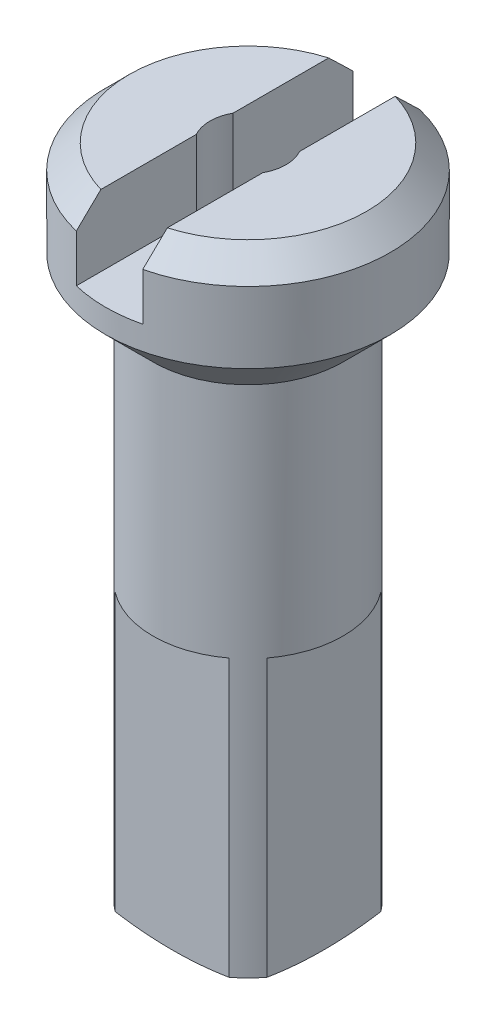
ISO-10303-21;
HEADER;
FILE_DESCRIPTION(('STEP AP214'),'2;1');
FILE_NAME('part.step','',(''),(''),'','','');
FILE_SCHEMA(('AUTOMOTIVE_DESIGN { 1 0 10303 214 1 1 1 1 }'));
ENDSEC;
DATA;
#1=APPLICATION_CONTEXT('core data for automotive mechanical design processes');
#2=APPLICATION_PROTOCOL_DEFINITION('international standard','automotive_design',2000,#1);
#3=PRODUCT_CONTEXT('',#1,'mechanical');
#4=PRODUCT('Part','Part','',(#3));
#5=PRODUCT_RELATED_PRODUCT_CATEGORY('part','',(#4));
#6=PRODUCT_DEFINITION_FORMATION('','',#4);
#7=PRODUCT_DEFINITION_CONTEXT('part definition',#1,'design');
#8=PRODUCT_DEFINITION('design','',#6,#7);
#9=PRODUCT_DEFINITION_SHAPE('','',#8);
#10=(LENGTH_UNIT() NAMED_UNIT(*) SI_UNIT(.MILLI.,.METRE.));
#11=(NAMED_UNIT(*) PLANE_ANGLE_UNIT() SI_UNIT($,.RADIAN.));
#12=(NAMED_UNIT(*) SI_UNIT($,.STERADIAN.) SOLID_ANGLE_UNIT());
#13=UNCERTAINTY_MEASURE_WITH_UNIT(LENGTH_MEASURE(1.E-05),#10,'distance_accuracy_value','');
#14=(GEOMETRIC_REPRESENTATION_CONTEXT(3) GLOBAL_UNCERTAINTY_ASSIGNED_CONTEXT((#13)) GLOBAL_UNIT_ASSIGNED_CONTEXT((#10,
#11,#12)) REPRESENTATION_CONTEXT('',''));
#15=CARTESIAN_POINT('',(0.,0.,0.));
#16=DIRECTION('',(0.,0.,1.));
#17=DIRECTION('',(1.,0.,0.));
#18=AXIS2_PLACEMENT_3D('',#15,#16,#17);
#19=CARTESIAN_POINT('',(0.,-17.3253086419753,0.));
#20=DIRECTION('',(0.,-1.00000000000001,0.));
#21=DIRECTION('',(0.,0.,-1.));
#22=AXIS2_PLACEMENT_3D('',#19,#20,#21);
#23=CYLINDRICAL_SURFACE('',#22,2.);
#24=CARTESIAN_POINT('',(0.,-2.99999999999961,0.));
#25=DIRECTION('',(0.,-1.00000000000001,0.));
#26=DIRECTION('',(0.,0.,-1.));
#27=AXIS2_PLACEMENT_3D('',#24,#25,#26);
#28=CIRCLE('',#27,2.);
#29=CARTESIAN_POINT('',(0.,-2.99999999999961,-2.00000000000004));
#30=VERTEX_POINT('',#29);
#31=EDGE_CURVE('E244',#30,#30,#28,.T.);
#32=ORIENTED_EDGE('',*,*,#31,.T.);
#33=EDGE_LOOP('',(#32));
#34=FACE_BOUND('',#33,.T.);
#35=DIRECTION('',(0.,-1.00000000000001,0.));
#36=VECTOR('',#35,1.);
#37=CARTESIAN_POINT('',(-1.60000000000001,-17.3253086419759,-1.19999999999996));
#38=LINE('',#37,#36);
#39=CARTESIAN_POINT('',(-1.60000000000003,-7.99999999999923,-1.20000000000007));
#40=VERTEX_POINT('',#39);
#41=CARTESIAN_POINT('',(-1.60000000000002,-13.8250385398487,-1.20000000000002));
#42=VERTEX_POINT('',#41);
#43=EDGE_CURVE('E43',#40,#42,#38,.T.);
#44=ORIENTED_EDGE('',*,*,#43,.F.);
#45=CARTESIAN_POINT('',(0.,-8.00000000000012,0.));
#46=DIRECTION('',(0.,1.00000000000001,0.));
#47=DIRECTION('',(0.,0.,1.));
#48=AXIS2_PLACEMENT_3D('',#45,#46,#47);
#49=CIRCLE('',#48,2.);
#50=CARTESIAN_POINT('',(-1.60000000000002,-8.00000000000034,1.20000000000006));
#51=VERTEX_POINT('',#50);
#52=EDGE_CURVE('E12',#40,#51,#49,.T.);
#53=ORIENTED_EDGE('',*,*,#52,.T.);
#54=DIRECTION('',(0.,-1.00000000000001,0.));
#55=VECTOR('',#54,1.);
#56=CARTESIAN_POINT('',(-1.60000000000001,-17.3253086419755,1.19999999999992));
#57=LINE('',#56,#55);
#58=CARTESIAN_POINT('',(-1.59999999999999,-13.8250385398481,1.19999999999997));
#59=VERTEX_POINT('',#58);
#60=EDGE_CURVE('E183',#59,#51,#57,.F.);
#61=ORIENTED_EDGE('',*,*,#60,.F.);
#62=CARTESIAN_POINT('',(0.,-13.8250385398488,0.));
#63=DIRECTION('',(0.,-1.00000000000001,0.));
#64=DIRECTION('',(0.,0.,-1.));
#65=AXIS2_PLACEMENT_3D('',#62,#63,#64);
#66=CIRCLE('',#65,2.);
#67=CARTESIAN_POINT('',(-1.20000000000003,-13.8250385398487,1.59999999999998));
#68=VERTEX_POINT('',#67);
#69=EDGE_CURVE('E169',#68,#59,#66,.T.);
#70=ORIENTED_EDGE('',*,*,#69,.F.);
#71=DIRECTION('',(0.,-1.00000000000001,0.));
#72=VECTOR('',#71,1.);
#73=CARTESIAN_POINT('',(-1.20000000000003,-17.3253086419754,1.60000000000005));
#74=LINE('',#73,#72);
#75=CARTESIAN_POINT('',(-1.20000000000002,-8.00000000000067,1.59999999999999));
#76=VERTEX_POINT('',#75);
#77=EDGE_CURVE('E51',#76,#68,#74,.T.);
#78=ORIENTED_EDGE('',*,*,#77,.F.);
#79=CARTESIAN_POINT('',(1.19999999999997,-8.00000000000095,1.59999999999999));
#80=VERTEX_POINT('',#79);
#81=EDGE_CURVE('E31',#76,#80,#49,.T.);
#82=ORIENTED_EDGE('',*,*,#81,.T.);
#83=DIRECTION('',(0.,-1.00000000000001,0.));
#84=VECTOR('',#83,1.);
#85=CARTESIAN_POINT('',(1.19999999999997,-17.3253086419757,1.6));
#86=LINE('',#85,#84);
#87=CARTESIAN_POINT('',(1.2,-13.8250385398482,1.59999999999991));
#88=VERTEX_POINT('',#87);
#89=EDGE_CURVE('E162',#88,#80,#86,.F.);
#90=ORIENTED_EDGE('',*,*,#89,.F.);
#91=CARTESIAN_POINT('',(1.6,-13.8250385398496,1.19999999999999));
#92=VERTEX_POINT('',#91);
#93=EDGE_CURVE('E245',#92,#88,#66,.T.);
#94=ORIENTED_EDGE('',*,*,#93,.F.);
#95=DIRECTION('',(0.,-1.00000000000001,0.));
#96=VECTOR('',#95,1.);
#97=CARTESIAN_POINT('',(1.59999999999998,-17.3253086419751,1.2));
#98=LINE('',#97,#96);
#99=CARTESIAN_POINT('',(1.59999999999998,-8.00000000000017,1.19999999999997));
#100=VERTEX_POINT('',#99);
#101=EDGE_CURVE('E172',#100,#92,#98,.T.);
#102=ORIENTED_EDGE('',*,*,#101,.F.);
#103=CARTESIAN_POINT('',(1.59999999999999,-7.99999999999995,-1.2));
#104=VERTEX_POINT('',#103);
#105=EDGE_CURVE('E159',#100,#104,#49,.T.);
#106=ORIENTED_EDGE('',*,*,#105,.T.);
#107=DIRECTION('',(0.,-1.00000000000001,0.));
#108=VECTOR('',#107,1.);
#109=CARTESIAN_POINT('',(1.59999999999998,-17.3253086419752,-1.20000000000003));
#110=LINE('',#109,#108);
#111=CARTESIAN_POINT('',(1.59999999999998,-13.8250385398487,-1.19999999999997));
#112=VERTEX_POINT('',#111);
#113=EDGE_CURVE('E170',#112,#104,#110,.F.);
#114=ORIENTED_EDGE('',*,*,#113,.F.);
#115=CARTESIAN_POINT('',(1.19999999999997,-13.8250385398483,-1.6));
#116=VERTEX_POINT('',#115);
#117=EDGE_CURVE('E241',#116,#112,#66,.T.);
#118=ORIENTED_EDGE('',*,*,#117,.F.);
#119=DIRECTION('',(0.,-1.00000000000001,0.));
#120=VECTOR('',#119,1.);
#121=CARTESIAN_POINT('',(1.19999999999999,-17.3253086419752,-1.6));
#122=LINE('',#121,#120);
#123=CARTESIAN_POINT('',(1.2,-7.99999999999912,-1.60000000000002));
#124=VERTEX_POINT('',#123);
#125=EDGE_CURVE('E181',#124,#116,#122,.T.);
#126=ORIENTED_EDGE('',*,*,#125,.F.);
#127=CARTESIAN_POINT('',(-1.20000000000003,-7.99999999999962,-1.60000000000008));
#128=VERTEX_POINT('',#127);
#129=EDGE_CURVE('E36',#124,#128,#49,.T.);
#130=ORIENTED_EDGE('',*,*,#129,.T.);
#131=DIRECTION('',(0.,-1.00000000000001,0.));
#132=VECTOR('',#131,1.);
#133=CARTESIAN_POINT('',(-1.20000000000002,-17.3253086419753,-1.60000000000002));
#134=LINE('',#133,#132);
#135=CARTESIAN_POINT('',(-1.20000000000004,-13.8250385398493,-1.6));
#136=VERTEX_POINT('',#135);
#137=EDGE_CURVE('E179',#136,#128,#134,.F.);
#138=ORIENTED_EDGE('',*,*,#137,.F.);
#139=EDGE_CURVE('E240',#42,#136,#66,.T.);
#140=ORIENTED_EDGE('',*,*,#139,.F.);
#141=EDGE_LOOP('',(#44,#53,#61,#70,#78,#82,#90,#94,#102,#106,#114,#118,#126,#130,#138,#140));
#142=FACE_BOUND('',#141,.T.);
#143=ADVANCED_FACE('F27',(#34,#142),#23,.T.);
#144=CARTESIAN_POINT('',(0.,-6.59662239244813,0.));
#145=DIRECTION('',(0.,-1.00000000000001,0.));
#146=DIRECTION('',(-0.999999999999998,0.,0.));
#147=AXIS2_PLACEMENT_3D('',#144,#145,#146);
#148=SPHERICAL_SURFACE('',#147,7.5);
#149=CARTESIAN_POINT('',(0.,-14.0000000000001,0.));
#150=DIRECTION('',(0.,-1.00000000000001,0.));
#151=DIRECTION('',(0.,0.,-1.));
#152=AXIS2_PLACEMENT_3D('',#149,#150,#151);
#153=CIRCLE('',#152,1.2);
#154=CARTESIAN_POINT('',(0.,-14.0000000000001,-1.19999999999997));
#155=VERTEX_POINT('',#154);
#156=EDGE_CURVE('E237',#155,#155,#153,.T.);
#157=ORIENTED_EDGE('',*,*,#156,.F.);
#158=EDGE_LOOP('',(#157));
#159=FACE_BOUND('',#158,.T.);
#160=CARTESIAN_POINT('',(-1.60000000000003,-6.59662239244857,0.));
#161=DIRECTION('',(-0.999999999999998,0.,0.));
#162=DIRECTION('',(0.,0.,1.));
#163=AXIS2_PLACEMENT_3D('',#160,#161,#162);
#164=CIRCLE('',#163,7.32734604068895);
#165=EDGE_CURVE('E160',#42,#59,#164,.T.);
#166=ORIENTED_EDGE('',*,*,#165,.F.);
#167=ORIENTED_EDGE('',*,*,#139,.T.);
#168=CARTESIAN_POINT('',(0.,-6.59662239244746,-1.60000000000004));
#169=DIRECTION('',(0.,0.,-1.));
#170=DIRECTION('',(-0.999999999999998,0.,0.));
#171=AXIS2_PLACEMENT_3D('',#168,#169,#170);
#172=CIRCLE('',#171,7.32734604068895);
#173=EDGE_CURVE('E364',#116,#136,#172,.T.);
#174=ORIENTED_EDGE('',*,*,#173,.F.);
#175=ORIENTED_EDGE('',*,*,#117,.T.);
#176=CARTESIAN_POINT('',(1.59999999999999,-6.59662239244835,0.));
#177=DIRECTION('',(0.999999999999998,0.,0.));
#178=DIRECTION('',(0.,0.,-1.));
#179=AXIS2_PLACEMENT_3D('',#176,#177,#178);
#180=CIRCLE('',#179,7.32734604068895);
#181=EDGE_CURVE('E360',#92,#112,#180,.T.);
#182=ORIENTED_EDGE('',*,*,#181,.F.);
#183=ORIENTED_EDGE('',*,*,#93,.T.);
#184=CARTESIAN_POINT('',(0.,-6.59662239244879,1.60000000000002));
#185=DIRECTION('',(0.,0.,1.));
#186=DIRECTION('',(0.999999999999998,0.,0.));
#187=AXIS2_PLACEMENT_3D('',#184,#185,#186);
#188=CIRCLE('',#187,7.32734604068895);
#189=EDGE_CURVE('E359',#68,#88,#188,.T.);
#190=ORIENTED_EDGE('',*,*,#189,.F.);
#191=ORIENTED_EDGE('',*,*,#69,.T.);
#192=EDGE_LOOP('',(#166,#167,#174,#175,#182,#183,#190,#191));
#193=FACE_BOUND('',#192,.T.);
#194=ADVANCED_FACE('F303',(#159,#193),#148,.T.);
#195=CARTESIAN_POINT('',(-0.800000000000018,6.10622663543836E-13,0.));
#196=DIRECTION('',(0.,-1.00000000000001,0.));
#197=DIRECTION('',(0.,0.,-1.));
#198=AXIS2_PLACEMENT_3D('',#195,#196,#197);
#199=PLANE('',#198);
#200=CARTESIAN_POINT('',(0.,0.,0.));
#201=DIRECTION('',(0.,-1.00000000000001,0.));
#202=DIRECTION('',(0.,0.,-1.));
#203=AXIS2_PLACEMENT_3D('',#200,#201,#202);
#204=CIRCLE('',#203,2.5);
#205=CARTESIAN_POINT('',(-0.700000000000011,1.11022302462516E-13,-2.39999999999999));
#206=VERTEX_POINT('',#205);
#207=CARTESIAN_POINT('',(-0.700000000000034,-1.66533453693773E-13,2.39999999999999));
#208=VERTEX_POINT('',#207);
#209=EDGE_CURVE('E255',#206,#208,#204,.F.);
#210=ORIENTED_EDGE('',*,*,#209,.T.);
#211=DIRECTION('',(0.,0.,1.));
#212=VECTOR('',#211,1.);
#213=CARTESIAN_POINT('',(-0.700000000000027,0.,-3.));
#214=LINE('',#213,#212);
#215=CARTESIAN_POINT('',(-0.700000000000041,-1.66533453693773E-13,0.3872983346207));
#216=VERTEX_POINT('',#215);
#217=EDGE_CURVE('E186',#216,#208,#214,.T.);
#218=ORIENTED_EDGE('',*,*,#217,.F.);
#219=CARTESIAN_POINT('',(0.,0.,0.));
#220=DIRECTION('',(0.,-1.00000000000001,0.));
#221=DIRECTION('',(0.,0.,-1.));
#222=AXIS2_PLACEMENT_3D('',#219,#220,#221);
#223=CIRCLE('',#222,0.8);
#224=CARTESIAN_POINT('',(-0.699999999999999,6.10622663543836E-13,-0.387298334620735));
#225=VERTEX_POINT('',#224);
#226=EDGE_CURVE('E227',#216,#225,#223,.T.);
#227=ORIENTED_EDGE('',*,*,#226,.T.);
#228=EDGE_CURVE('E188',#206,#225,#214,.T.);
#229=ORIENTED_EDGE('',*,*,#228,.F.);
#230=EDGE_LOOP('',(#210,#218,#227,#229));
#231=FACE_BOUND('',#230,.T.);
#232=ADVANCED_FACE('F310',(#231),#199,.F.);
#233=CARTESIAN_POINT('',(0.,-0.499999999999778,0.));
#234=DIRECTION('',(0.,-1.00000000000001,0.));
#235=DIRECTION('',(0.,0.,-1.));
#236=AXIS2_PLACEMENT_3D('',#233,#234,#235);
#237=CONICAL_SURFACE('',#236,3.,0.78539816339745);
#238=CARTESIAN_POINT('',(-0.700000000000017,-4.11267837363771,-6.57552395426984));
#239=CARTESIAN_POINT('',(-0.700000000000024,-3.92301081977909,-6.38478036232658));
#240=CARTESIAN_POINT('',(-0.700000000000027,-3.73338557460652,-6.19399466736224));
#241=CARTESIAN_POINT('',(-0.700000000000029,-3.35423155800773,-5.81227402664939));
#242=CARTESIAN_POINT('',(-0.700000000000028,-3.16470280394466,-5.62133906365563));
#243=CARTESIAN_POINT('',(-0.700000000000028,-2.78517584282959,-5.23867209630791));
#244=CARTESIAN_POINT('',(-0.700000000000028,-2.5951781758625,-5.04693955608172));
#245=CARTESIAN_POINT('',(-0.700000000000028,-2.21543987689608,-4.66327293310283));
#246=CARTESIAN_POINT('',(-0.700000000000028,-2.02569921283583,-4.471338882074));
#247=CARTESIAN_POINT('',(-0.700000000000028,-1.5714182129493,-4.01103176965299));
#248=CARTESIAN_POINT('',(-0.700000000000029,-1.30703134017998,-3.74250697714998));
#249=CARTESIAN_POINT('',(-0.700000000000029,-0.911273570529878,-3.33878342656647));
#250=CARTESIAN_POINT('',(-0.700000000000029,-0.779459115497286,-3.20401961997148));
#251=CARTESIAN_POINT('',(-0.700000000000029,-0.516271036792303,-2.93407602524108));
#252=CARTESIAN_POINT('',(-0.700000000000029,-0.384897389518707,-2.79889626014404));
#253=CARTESIAN_POINT('',(-0.700000000000029,-0.123195297111526,-2.52830610706533));
#254=CARTESIAN_POINT('',(-0.700000000000029,0.0071350951152486,-2.3928976030103));
#255=CARTESIAN_POINT('',(-0.700000000000029,0.266787508907384,-2.12105937223387));
#256=CARTESIAN_POINT('',(-0.700000000000029,0.396109317429233,-1.98462944107911));
#257=CARTESIAN_POINT('',(-0.700000000000029,0.588633010666352,-1.77873561986846));
#258=CARTESIAN_POINT('',(-0.70000000000003,0.652535702083623,-1.70992773783144));
#259=CARTESIAN_POINT('',(-0.700000000000029,0.779677995979203,-1.57170281667876));
#260=CARTESIAN_POINT('',(-0.700000000000027,0.842917611890001,-1.50228578995559));
#261=CARTESIAN_POINT('',(-0.700000000000032,0.96841247649111,-1.36260789138266));
#262=CARTESIAN_POINT('',(-0.700000000000038,1.03066804490164,-1.29234730722837));
#263=CARTESIAN_POINT('',(-0.700000000000021,1.15370572568725,-1.15055077991614));
#264=CARTESIAN_POINT('',(-0.699999999999996,1.21448803755741,-1.07901501173458));
#265=CARTESIAN_POINT('',(-0.700000000000015,1.29718344015595,-0.978274405697599));
#266=CARTESIAN_POINT('',(-0.700000000000026,1.32014114678459,-0.949927936687709));
#267=CARTESIAN_POINT('',(-0.700000000000034,1.36558654555469,-0.892856998726736));
#268=CARTESIAN_POINT('',(-0.700000000000031,1.38807421024344,-0.864132507856136));
#269=CARTESIAN_POINT('',(-0.700000000000028,1.43250501678596,-0.806159354933486));
#270=CARTESIAN_POINT('',(-0.700000000000029,1.45444679133065,-0.776909641694235));
#271=CARTESIAN_POINT('',(-0.70000000000003,1.4975561052671,-0.717845233228813));
#272=CARTESIAN_POINT('',(-0.700000000000029,1.5187236921678,-0.688030572842337));
#273=CARTESIAN_POINT('',(-0.70000000000003,1.55956277185305,-0.628397609543758));
#274=CARTESIAN_POINT('',(-0.70000000000003,1.57925754399882,-0.598595339755328));
#275=CARTESIAN_POINT('',(-0.700000000000029,1.61734551620212,-0.538172236658653));
#276=CARTESIAN_POINT('',(-0.700000000000027,1.63573900831914,-0.507551589166462));
#277=CARTESIAN_POINT('',(-0.700000000000032,1.67070401695575,-0.445409706613224));
#278=CARTESIAN_POINT('',(-0.700000000000038,1.68728133398369,-0.413891769361653));
#279=CARTESIAN_POINT('',(-0.700000000000022,1.71801347852738,-0.349708018920922));
#280=CARTESIAN_POINT('',(-0.7,1.73217075067366,-0.317043404758527));
#281=CARTESIAN_POINT('',(-0.70000000000001,1.75249213341929,-0.262941491411196));
#282=CARTESIAN_POINT('',(-0.700000000000024,1.7596632881924,-0.241885007618641));
#283=CARTESIAN_POINT('',(-0.700000000000035,1.77246356715623,-0.199308339763908));
#284=CARTESIAN_POINT('',(-0.700000000000032,1.77809255000601,-0.177788113394297));
#285=CARTESIAN_POINT('',(-0.700000000000025,1.79220576963066,-0.112849032392101));
#286=CARTESIAN_POINT('',(-0.700000000000022,1.79802065121236,-0.0687903185515554));
#287=CARTESIAN_POINT('',(-0.700000000000024,1.80112661125644,0.0199189402820946));
#288=CARTESIAN_POINT('',(-0.700000000000028,1.79836244733507,0.0645714696930973));
#289=CARTESIAN_POINT('',(-0.700000000000031,1.78486551445167,0.152783563875291));
#290=CARTESIAN_POINT('',(-0.700000000000029,1.77409604002,0.196337135635894));
#291=CARTESIAN_POINT('',(-0.700000000000028,1.74675830151373,0.281022099669121));
#292=CARTESIAN_POINT('',(-0.70000000000003,1.73024652915394,0.322172686253591));
#293=CARTESIAN_POINT('',(-0.70000000000003,1.69323845925868,0.40267184433412));
#294=CARTESIAN_POINT('',(-0.700000000000028,1.67273531340072,0.442017172950594));
#295=CARTESIAN_POINT('',(-0.700000000000031,1.62890499307269,0.519453413889727));
#296=CARTESIAN_POINT('',(-0.700000000000035,1.60555825450233,0.557533042326062));
#297=CARTESIAN_POINT('',(-0.700000000000024,1.55703602592909,0.632450062660897));
#298=CARTESIAN_POINT('',(-0.700000000000009,1.53186203849033,0.669288439554436));
#299=CARTESIAN_POINT('',(-0.700000000000007,1.4780815773246,0.745041416598977));
#300=CARTESIAN_POINT('',(-0.700000000000023,1.44936334950984,0.783876100518569));
#301=CARTESIAN_POINT('',(-0.700000000000036,1.3908433681408,0.860723249482076));
#302=CARTESIAN_POINT('',(-0.700000000000032,1.36104146370459,0.898735598846912));
#303=CARTESIAN_POINT('',(-0.700000000000025,1.2704375843275,1.01187256789841));
#304=CARTESIAN_POINT('',(-0.700000000000028,1.20846632319658,1.0860578230274));
#305=CARTESIAN_POINT('',(-0.700000000000031,1.08263133847016,1.23302643475662));
#306=CARTESIAN_POINT('',(-0.70000000000003,1.01876428351992,1.30580690112389));
#307=CARTESIAN_POINT('',(-0.700000000000029,0.889911302287086,1.4503292775563));
#308=CARTESIAN_POINT('',(-0.70000000000003,0.824925719155832,1.52207149413541));
#309=CARTESIAN_POINT('',(-0.70000000000003,0.694342743232183,1.66469678369502));
#310=CARTESIAN_POINT('',(-0.70000000000003,0.628747064634135,1.73558143166386));
#311=CARTESIAN_POINT('',(-0.70000000000003,0.497016135847303,1.87685691083946));
#312=CARTESIAN_POINT('',(-0.70000000000003,0.430880845393854,1.94724770445335));
#313=CARTESIAN_POINT('',(-0.700000000000029,0.232048140350243,2.15771678265417));
#314=CARTESIAN_POINT('',(-0.700000000000027,0.0987761296277188,2.2972516439705));
#315=CARTESIAN_POINT('',(-0.700000000000027,-0.203030523568541,2.61126170228683));
#316=CARTESIAN_POINT('',(-0.700000000000029,-0.371818305150281,2.7854928212261));
#317=CARTESIAN_POINT('',(-0.70000000000003,-0.710186317399799,3.1331877943132));
#318=CARTESIAN_POINT('',(-0.70000000000003,-0.87976655976597,3.30665163706037));
#319=CARTESIAN_POINT('',(-0.700000000000029,-1.38939109811971,3.82650453677007));
#320=CARTESIAN_POINT('',(-0.700000000000029,-1.73015595359525,4.17218658000089));
#321=CARTESIAN_POINT('',(-0.70000000000003,-2.41103868943589,4.86116499996148));
#322=CARTESIAN_POINT('',(-0.700000000000031,-2.7511527488021,5.20446516132608));
#323=CARTESIAN_POINT('',(-0.700000000000029,-3.26160142582111,5.71896032997363));
#324=CARTESIAN_POINT('',(-0.700000000000027,-3.43175225537459,5.8903376524664));
#325=CARTESIAN_POINT('',(-0.700000000000031,-3.7721498149686,6.23299628430987));
#326=CARTESIAN_POINT('',(-0.700000000000036,-3.94239654479693,6.40427759387137));
#327=CARTESIAN_POINT('',(-0.700000000000048,-4.11267837363805,6.57552395426987));
#328=B_SPLINE_CURVE_WITH_KNOTS('',3,(#238,#239,#240,#241,#242,#243,#244,#245,#246,#247,#248,
#249,#250,#251,#252,#253,#254,#255,#256,#257,#258,#259,#260,#261,#262,#263,#264,#265,#266,#267,
#268,#269,#270,#271,#272,#273,#274,#275,#276,#277,#278,#279,#280,#281,#282,#283,#284,#285,#286,
#287,#288,#289,#290,#291,#292,#293,#294,#295,#296,#297,#298,#299,#300,#301,#302,#303,#304,#305,
#306,#307,#308,#309,#310,#311,#312,#313,#314,#315,#316,#317,#318,#319,#320,#321,#322,#323,#324,
#325,#326,#327),.UNSPECIFIED.,.F.,.F.,(4,2,2,2,2,2,2,2,2,2,2,2,2,2,2,2,2,2,2,2,2,2,2,2,2,2,2,2,
2,2,2,2,2,2,2,2,2,2,2,2,2,2,2,2,4),(0.,0.806977153790863,1.6140680397872,2.42384826610812,
3.23351591710163,4.36402380844408,4.92955574844324,5.49505691015564,6.05887494208497,
6.62280900822355,6.90452016877082,7.1862256113841,7.46783756341355,7.74941116661387,
7.85883867169515,7.96827255011133,8.07795744176208,8.18763559113466,8.29477703393027,
8.40189435309281,8.50865892239354,8.61531499684757,8.68199436301535,8.74867983834193,
8.88121544996418,9.01460625444733,9.14861247661523,9.28133601428111,9.41428931614784,
9.54821535253698,9.68203248139371,9.82690533667768,9.97179844064679,10.2617307869164,
10.5522069057218,10.8425954444747,11.1323278384884,11.4220820531021,12.0009374135891,
12.7286782160555,13.4564297956637,14.9126365345611,16.3623925093967,17.0868877436305,
17.8113813809737),.UNSPECIFIED.);
#329=CARTESIAN_POINT('',(-0.70000000000001,-0.500000000000056,-2.91719042916296));
#330=VERTEX_POINT('',#329);
#331=EDGE_CURVE('E339',#330,#206,#328,.T.);
#332=ORIENTED_EDGE('',*,*,#331,.F.);
#333=CARTESIAN_POINT('',(0.,-0.499999999999778,0.));
#334=DIRECTION('',(0.,-1.00000000000001,0.));
#335=DIRECTION('',(0.,0.,-1.));
#336=AXIS2_PLACEMENT_3D('',#333,#334,#335);
#337=CIRCLE('',#336,3.);
#338=CARTESIAN_POINT('',(-0.70000000000002,-0.499999999999556,2.91719042916289));
#339=VERTEX_POINT('',#338);
#340=EDGE_CURVE('E251',#339,#330,#337,.T.);
#341=ORIENTED_EDGE('',*,*,#340,.F.);
#342=EDGE_CURVE('E267',#208,#339,#328,.T.);
#343=ORIENTED_EDGE('',*,*,#342,.F.);
#344=ORIENTED_EDGE('',*,*,#209,.F.);
#345=EDGE_LOOP('',(#332,#341,#343,#344));
#346=FACE_BOUND('',#345,.T.);
#347=ADVANCED_FACE('F297',(#346),#237,.T.);
#348=CARTESIAN_POINT('',(0.,-17.3253086419753,0.));
#349=DIRECTION('',(0.,-1.00000000000001,0.));
#350=DIRECTION('',(0.,0.,-1.));
#351=AXIS2_PLACEMENT_3D('',#348,#349,#350);
#352=CYLINDRICAL_SURFACE('',#351,3.);
#353=ORIENTED_EDGE('',*,*,#340,.T.);
#354=DIRECTION('',(0.,-1.00000000000001,0.));
#355=VECTOR('',#354,1.);
#356=CARTESIAN_POINT('',(-0.700000000000015,-17.3253086419746,-2.91719042916297));
#357=LINE('',#356,#355);
#358=CARTESIAN_POINT('',(-0.700000000000041,-1.50000000000022,-2.9171904291629));
#359=VERTEX_POINT('',#358);
#360=EDGE_CURVE('E215',#330,#359,#357,.T.);
#361=ORIENTED_EDGE('',*,*,#360,.T.);
#362=CARTESIAN_POINT('',(0.,-1.5000000000005,0.));
#363=DIRECTION('',(0.,1.00000000000001,0.));
#364=DIRECTION('',(0.,0.,1.));
#365=AXIS2_PLACEMENT_3D('',#362,#363,#364);
#366=CIRCLE('',#365,3.);
#367=CARTESIAN_POINT('',(0.69999999999994,-1.49999999999995,-2.917190429163));
#368=VERTEX_POINT('',#367);
#369=EDGE_CURVE('E225',#368,#359,#366,.T.);
#370=ORIENTED_EDGE('',*,*,#369,.F.);
#371=DIRECTION('',(0.,-1.00000000000001,0.));
#372=VECTOR('',#371,1.);
#373=CARTESIAN_POINT('',(0.699999999999965,-17.3253086419752,-2.917190429163));
#374=LINE('',#373,#372);
#375=CARTESIAN_POINT('',(0.70000000000001,-0.499999999999556,-2.91719042916308));
#376=VERTEX_POINT('',#375);
#377=EDGE_CURVE('E200',#368,#376,#374,.F.);
#378=ORIENTED_EDGE('',*,*,#377,.T.);
#379=CARTESIAN_POINT('',(0.700000000000003,-0.499999999999667,2.91719042916294));
#380=VERTEX_POINT('',#379);
#381=EDGE_CURVE('E254',#376,#380,#337,.T.);
#382=ORIENTED_EDGE('',*,*,#381,.T.);
#383=DIRECTION('',(0.,-1.00000000000001,0.));
#384=VECTOR('',#383,1.);
#385=CARTESIAN_POINT('',(0.699999999999982,-17.3253086419753,2.91719042916292));
#386=LINE('',#385,#384);
#387=CARTESIAN_POINT('',(0.699999999999972,-1.49999999999983,2.91719042916298));
#388=VERTEX_POINT('',#387);
#389=EDGE_CURVE('E203',#380,#388,#386,.T.);
#390=ORIENTED_EDGE('',*,*,#389,.T.);
#391=CARTESIAN_POINT('',(-0.700000000000011,-1.50000000000011,2.91719042916305));
#392=VERTEX_POINT('',#391);
#393=EDGE_CURVE('E224',#392,#388,#366,.T.);
#394=ORIENTED_EDGE('',*,*,#393,.F.);
#395=DIRECTION('',(0.,-1.00000000000001,0.));
#396=VECTOR('',#395,1.);
#397=CARTESIAN_POINT('',(-0.699999999999985,-17.3253086419746,2.91719042916289));
#398=LINE('',#397,#396);
#399=EDGE_CURVE('E212',#392,#339,#398,.F.);
#400=ORIENTED_EDGE('',*,*,#399,.T.);
#401=EDGE_LOOP('',(#353,#361,#370,#378,#382,#390,#394,#400));
#402=FACE_BOUND('',#401,.T.);
#403=CARTESIAN_POINT('',(0.,-1.99999999999967,0.));
#404=DIRECTION('',(0.,-1.00000000000001,0.));
#405=DIRECTION('',(0.,0.,-1.));
#406=AXIS2_PLACEMENT_3D('',#403,#404,#405);
#407=CIRCLE('',#406,3.);
#408=CARTESIAN_POINT('',(0.,-1.99999999999967,-3.00000000000003));
#409=VERTEX_POINT('',#408);
#410=EDGE_CURVE('E248',#409,#409,#407,.T.);
#411=ORIENTED_EDGE('',*,*,#410,.F.);
#412=EDGE_LOOP('',(#411));
#413=FACE_BOUND('',#412,.T.);
#414=ADVANCED_FACE('F29',(#402,#413),#352,.T.);
#415=CARTESIAN_POINT('',(0.,-1.99999999999967,0.));
#416=DIRECTION('',(0.,1.00000000000001,0.));
#417=DIRECTION('',(0.,0.,1.));
#418=AXIS2_PLACEMENT_3D('',#415,#416,#417);
#419=CONICAL_SURFACE('',#418,3.,0.785398163397449);
#420=ORIENTED_EDGE('',*,*,#31,.F.);
#421=EDGE_LOOP('',(#420));
#422=FACE_BOUND('',#421,.T.);
#423=ORIENTED_EDGE('',*,*,#410,.T.);
#424=EDGE_LOOP('',(#423));
#425=FACE_BOUND('',#424,.T.);
#426=ADVANCED_FACE('F314',(#422,#425),#419,.T.);
#427=CARTESIAN_POINT('',(0.,-17.3253086419753,0.));
#428=DIRECTION('',(0.,-1.00000000000001,0.));
#429=DIRECTION('',(0.,0.,-1.));
#430=AXIS2_PLACEMENT_3D('',#427,#428,#429);
#431=CYLINDRICAL_SURFACE('',#430,1.2);
#432=CARTESIAN_POINT('',(0.,-8.00000000000012,0.));
#433=DIRECTION('',(0.,-1.00000000000001,0.));
#434=DIRECTION('',(0.,0.,-1.));
#435=AXIS2_PLACEMENT_3D('',#432,#433,#434);
#436=CIRCLE('',#435,1.2);
#437=CARTESIAN_POINT('',(0.,-8.00000000000012,-1.20000000000002));
#438=VERTEX_POINT('',#437);
#439=EDGE_CURVE('E234',#438,#438,#436,.T.);
#440=ORIENTED_EDGE('',*,*,#439,.F.);
#441=EDGE_LOOP('',(#440));
#442=FACE_BOUND('',#441,.T.);
#443=ORIENTED_EDGE('',*,*,#156,.T.);
#444=EDGE_LOOP('',(#443));
#445=FACE_BOUND('',#444,.T.);
#446=ADVANCED_FACE('F316',(#442,#445),#431,.F.);
#447=CARTESIAN_POINT('',(-1.2,-8.00000000000023,0.));
#448=DIRECTION('',(0.,1.00000000000001,0.));
#449=DIRECTION('',(0.,0.,1.));
#450=AXIS2_PLACEMENT_3D('',#447,#448,#449);
#451=PLANE('',#450);
#452=CARTESIAN_POINT('',(0.,-8.00000000000012,0.));
#453=DIRECTION('',(0.,-1.00000000000001,0.));
#454=DIRECTION('',(0.,0.,-1.));
#455=AXIS2_PLACEMENT_3D('',#452,#453,#454);
#456=CIRCLE('',#455,0.8);
#457=CARTESIAN_POINT('',(0.,-8.00000000000012,-0.800000000000023));
#458=VERTEX_POINT('',#457);
#459=EDGE_CURVE('E231',#458,#458,#456,.T.);
#460=ORIENTED_EDGE('',*,*,#459,.F.);
#461=EDGE_LOOP('',(#460));
#462=FACE_BOUND('',#461,.T.);
#463=ORIENTED_EDGE('',*,*,#439,.T.);
#464=EDGE_LOOP('',(#463));
#465=FACE_BOUND('',#464,.T.);
#466=ADVANCED_FACE('F322',(#462,#465),#451,.F.);
#467=CARTESIAN_POINT('',(0.,-17.3253086419753,0.));
#468=DIRECTION('',(0.,-1.00000000000001,0.));
#469=DIRECTION('',(0.,0.,-1.));
#470=AXIS2_PLACEMENT_3D('',#467,#468,#469);
#471=CYLINDRICAL_SURFACE('',#470,0.8);
#472=CARTESIAN_POINT('',(0.,-1.5000000000005,0.));
#473=DIRECTION('',(0.,1.00000000000001,0.));
#474=DIRECTION('',(0.,0.,1.));
#475=AXIS2_PLACEMENT_3D('',#472,#473,#474);
#476=CIRCLE('',#475,0.8);
#477=CARTESIAN_POINT('',(-0.700000000000029,-1.49999999999983,-0.387298334620721));
#478=VERTEX_POINT('',#477);
#479=CARTESIAN_POINT('',(0.699999999999958,-1.50000000000056,-0.387298334620728));
#480=VERTEX_POINT('',#479);
#481=EDGE_CURVE('E342',#478,#480,#476,.F.);
#482=ORIENTED_EDGE('',*,*,#481,.F.);
#483=DIRECTION('',(0.,-1.00000000000001,0.));
#484=VECTOR('',#483,1.);
#485=CARTESIAN_POINT('',(-0.700000000000013,-17.3253086419753,-0.387298334620777));
#486=LINE('',#485,#484);
#487=EDGE_CURVE('E221',#478,#225,#486,.F.);
#488=ORIENTED_EDGE('',*,*,#487,.T.);
#489=ORIENTED_EDGE('',*,*,#226,.F.);
#490=DIRECTION('',(0.,-1.00000000000001,0.));
#491=VECTOR('',#490,1.);
#492=CARTESIAN_POINT('',(-0.700000000000041,-17.3253086419753,0.387298334620777));
#493=LINE('',#492,#491);
#494=CARTESIAN_POINT('',(-0.70000000000002,-1.49999999999978,0.387298334620714));
#495=VERTEX_POINT('',#494);
#496=EDGE_CURVE('E218',#216,#495,#493,.T.);
#497=ORIENTED_EDGE('',*,*,#496,.T.);
#498=CARTESIAN_POINT('',(0.699999999999989,-1.50000000000011,0.387298334620763));
#499=VERTEX_POINT('',#498);
#500=EDGE_CURVE('E341',#499,#495,#476,.F.);
#501=ORIENTED_EDGE('',*,*,#500,.F.);
#502=DIRECTION('',(0.,-1.00000000000001,0.));
#503=VECTOR('',#502,1.);
#504=CARTESIAN_POINT('',(0.699999999999985,-17.3253086419757,0.38729833462077));
#505=LINE('',#504,#503);
#506=CARTESIAN_POINT('',(0.699999999999985,4.9960036108132E-13,0.387298334620687));
#507=VERTEX_POINT('',#506);
#508=EDGE_CURVE('E209',#499,#507,#505,.F.);
#509=ORIENTED_EDGE('',*,*,#508,.T.);
#510=CARTESIAN_POINT('',(0.700000000000023,2.77555756156289E-13,-0.387298334620798));
#511=VERTEX_POINT('',#510);
#512=EDGE_CURVE('E228',#511,#507,#223,.T.);
#513=ORIENTED_EDGE('',*,*,#512,.F.);
#514=DIRECTION('',(0.,-1.00000000000001,0.));
#515=VECTOR('',#514,1.);
#516=CARTESIAN_POINT('',(0.699999999999958,-17.3253086419754,-0.387298334620659));
#517=LINE('',#516,#515);
#518=EDGE_CURVE('E206',#511,#480,#517,.T.);
#519=ORIENTED_EDGE('',*,*,#518,.T.);
#520=EDGE_LOOP('',(#482,#488,#489,#497,#501,#509,#513,#519));
#521=FACE_BOUND('',#520,.T.);
#522=ORIENTED_EDGE('',*,*,#459,.T.);
#523=EDGE_LOOP('',(#522));
#524=FACE_BOUND('',#523,.T.);
#525=ADVANCED_FACE('F424',(#521,#524),#471,.F.);
#526=CARTESIAN_POINT('',(0.699999999999954,-1.66533453693773E-13,2.40000000000001));
#527=VERTEX_POINT('',#526);
#528=CARTESIAN_POINT('',(0.699999999999961,-9.43689570931383E-13,-2.39999999999996));
#529=VERTEX_POINT('',#528);
#530=EDGE_CURVE('E259',#527,#529,#204,.F.);
#531=ORIENTED_EDGE('',*,*,#530,.T.);
#532=DIRECTION('',(0.,0.,-1.));
#533=VECTOR('',#532,1.);
#534=CARTESIAN_POINT('',(0.699999999999951,-3.88578058618805E-13,-2.99999999999998));
#535=LINE('',#534,#533);
#536=EDGE_CURVE('E189',#511,#529,#535,.T.);
#537=ORIENTED_EDGE('',*,*,#536,.F.);
#538=ORIENTED_EDGE('',*,*,#512,.T.);
#539=EDGE_CURVE('E191',#527,#507,#535,.T.);
#540=ORIENTED_EDGE('',*,*,#539,.F.);
#541=EDGE_LOOP('',(#531,#537,#538,#540));
#542=FACE_BOUND('',#541,.T.);
#543=ADVANCED_FACE('F295',(#542),#199,.F.);
#544=CARTESIAN_POINT('',(0.699999999999989,-4.11267837363771,6.57552395426983));
#545=CARTESIAN_POINT('',(0.699999999999986,-3.9230108197795,6.38478036232698));
#546=CARTESIAN_POINT('',(0.699999999999985,-3.73338557460734,6.19399466736305));
#547=CARTESIAN_POINT('',(0.699999999999985,-3.35423155800937,5.81227402665103));
#548=CARTESIAN_POINT('',(0.699999999999985,-3.16470280394671,5.62133906365768));
#549=CARTESIAN_POINT('',(0.699999999999985,-2.78517584283247,5.23867209631081));
#550=CARTESIAN_POINT('',(0.699999999999985,-2.59517817586581,5.04693955608505));
#551=CARTESIAN_POINT('',(0.699999999999985,-2.21543987690023,4.66327293310702));
#552=CARTESIAN_POINT('',(0.699999999999985,-2.0256992128404,4.47133888207862));
#553=CARTESIAN_POINT('',(0.699999999999985,-1.57141821295389,4.01103176965764));
#554=CARTESIAN_POINT('',(0.699999999999985,-1.30703134018416,3.74250697715423));
#555=CARTESIAN_POINT('',(0.699999999999985,-0.911273570533458,3.33878342657012));
#556=CARTESIAN_POINT('',(0.699999999999985,-0.779459115500665,3.20401961997494));
#557=CARTESIAN_POINT('',(0.699999999999985,-0.516271036795282,2.93407602524413));
#558=CARTESIAN_POINT('',(0.699999999999985,-0.384897389521484,2.7988962601469));
#559=CARTESIAN_POINT('',(0.699999999999985,-0.123195297113891,2.52830610706778));
#560=CARTESIAN_POINT('',(0.699999999999984,0.00713509511309434,2.39289760301254));
#561=CARTESIAN_POINT('',(0.699999999999985,0.266787508905643,2.1210593722357));
#562=CARTESIAN_POINT('',(0.699999999999985,0.396109317427694,1.98462944108073));
#563=CARTESIAN_POINT('',(0.699999999999984,0.588633010665128,1.77873561986977));
#564=CARTESIAN_POINT('',(0.699999999999984,0.652535702082506,1.70992773783265));
#565=CARTESIAN_POINT('',(0.699999999999985,0.779677995978284,1.57170281667975));
#566=CARTESIAN_POINT('',(0.699999999999985,0.842917611889174,1.50228578995647));
#567=CARTESIAN_POINT('',(0.699999999999983,0.968412476490527,1.36260789138335));
#568=CARTESIAN_POINT('',(0.699999999999981,1.03066804490121,1.29234730722898));
#569=CARTESIAN_POINT('',(0.699999999999988,1.1537057256869,1.15055077991641));
#570=CARTESIAN_POINT('',(0.699999999999998,1.21448803755699,1.07901501173459));
#571=CARTESIAN_POINT('',(0.69999999999999,1.29718344015578,0.978274405697589));
#572=CARTESIAN_POINT('',(0.699999999999986,1.32014114678451,0.94992793668775));
#573=CARTESIAN_POINT('',(0.699999999999983,1.36558654555469,0.892856998726799));
#574=CARTESIAN_POINT('',(0.699999999999984,1.38807421024343,0.864132507856169));
#575=CARTESIAN_POINT('',(0.699999999999985,1.43250501678595,0.806159354933484));
#576=CARTESIAN_POINT('',(0.699999999999985,1.45444679133066,0.776909641694226));
#577=CARTESIAN_POINT('',(0.699999999999984,1.49755610526712,0.717845233228786));
#578=CARTESIAN_POINT('',(0.699999999999984,1.51872369216783,0.688030572842297));
#579=CARTESIAN_POINT('',(0.699999999999985,1.55956277185309,0.628397609543712));
#580=CARTESIAN_POINT('',(0.699999999999985,1.57925754399884,0.598595339755289));
#581=CARTESIAN_POINT('',(0.699999999999984,1.61734551620214,0.538172236658626));
#582=CARTESIAN_POINT('',(0.699999999999983,1.63573900831915,0.507551589166441));
#583=CARTESIAN_POINT('',(0.699999999999986,1.67070401695576,0.445409706613214));
#584=CARTESIAN_POINT('',(0.699999999999989,1.68728133398371,0.413891769361647));
#585=CARTESIAN_POINT('',(0.69999999999998,1.71801347852739,0.349708018920919));
#586=CARTESIAN_POINT('',(0.699999999999968,1.73217075067366,0.317043404758524));
#587=CARTESIAN_POINT('',(0.699999999999973,1.75249213341928,0.262941491411209));
#588=CARTESIAN_POINT('',(0.699999999999981,1.7596632881924,0.241885007618668));
#589=CARTESIAN_POINT('',(0.699999999999988,1.77246356715623,0.199308339763966));
#590=CARTESIAN_POINT('',(0.699999999999986,1.77809255000602,0.177788113394371));
#591=CARTESIAN_POINT('',(0.699999999999981,1.79220576963063,0.112849032392195));
#592=CARTESIAN_POINT('',(0.699999999999979,1.79802065121221,0.0687903185516455));
#593=CARTESIAN_POINT('',(0.699999999999978,1.80112661125626,-0.0199189402820083));
#594=CARTESIAN_POINT('',(0.699999999999979,1.79836244733499,-0.0645714696930101));
#595=CARTESIAN_POINT('',(0.69999999999999,1.78486551445181,-0.152783563875234));
#596=CARTESIAN_POINT('',(0.7,1.77409604002027,-0.196337135635869));
#597=CARTESIAN_POINT('',(0.699999999999999,1.746758301514,-0.28102209966909));
#598=CARTESIAN_POINT('',(0.699999999999988,1.73024652915407,-0.322172686253521));
#599=CARTESIAN_POINT('',(0.699999999999981,1.69323845925867,-0.402671844334037));
#600=CARTESIAN_POINT('',(0.699999999999984,1.67273531340073,-0.442017172950536));
#601=CARTESIAN_POINT('',(0.699999999999985,1.62890499307274,-0.519453413889765));
#602=CARTESIAN_POINT('',(0.699999999999984,1.60555825450239,-0.557533042326171));
#603=CARTESIAN_POINT('',(0.699999999999985,1.55703602592895,-0.632450062660985));
#604=CARTESIAN_POINT('',(0.699999999999989,1.53186203848998,-0.669288439554433));
#605=CARTESIAN_POINT('',(0.699999999999989,1.4780815773242,-0.745041416598998));
#606=CARTESIAN_POINT('',(0.699999999999986,1.44936334950964,-0.783876100518727));
#607=CARTESIAN_POINT('',(0.699999999999983,1.39084336814074,-0.860723249482331));
#608=CARTESIAN_POINT('',(0.699999999999984,1.36104146370449,-0.898735598847127));
#609=CARTESIAN_POINT('',(0.699999999999986,1.27043758432733,-1.01187256789854));
#610=CARTESIAN_POINT('',(0.699999999999985,1.20846632319646,-1.08605782302754));
#611=CARTESIAN_POINT('',(0.699999999999984,1.08263133847009,-1.23302643475674));
#612=CARTESIAN_POINT('',(0.699999999999985,1.01876428351987,-1.30580690112399));
#613=CARTESIAN_POINT('',(0.699999999999985,0.889911302287045,-1.45032927755636));
#614=CARTESIAN_POINT('',(0.699999999999985,0.824925719155804,-1.52207149413545));
#615=CARTESIAN_POINT('',(0.699999999999985,0.694342743232229,-1.664696783695));
#616=CARTESIAN_POINT('',(0.699999999999984,0.628747064634244,-1.73558143166379));
#617=CARTESIAN_POINT('',(0.699999999999985,0.497016135847494,-1.87685691083925));
#618=CARTESIAN_POINT('',(0.699999999999987,0.430880845394063,-1.94724770445305));
#619=CARTESIAN_POINT('',(0.69999999999998,0.232048140350771,-2.15771678265384));
#620=CARTESIAN_POINT('',(0.699999999999961,0.0987761296288144,-2.29725164397049));
#621=CARTESIAN_POINT('',(0.699999999999954,-0.20303052356709,-2.61126170228678));
#622=CARTESIAN_POINT('',(0.699999999999977,-0.371818305149266,-2.78549282122547));
#623=CARTESIAN_POINT('',(0.699999999999994,-0.710186317399009,-3.13318779431202));
#624=CARTESIAN_POINT('',(0.699999999999988,-0.879766559764969,-3.30665163705922));
#625=CARTESIAN_POINT('',(0.69999999999998,-1.38939109811826,-3.82650453676887));
#626=CARTESIAN_POINT('',(0.699999999999984,-1.73015595359373,-4.17218657999943));
#627=CARTESIAN_POINT('',(0.699999999999987,-2.41103868943454,-4.86116499996004));
#628=CARTESIAN_POINT('',(0.699999999999985,-2.75115274880099,-5.20446516132494));
#629=CARTESIAN_POINT('',(0.699999999999986,-3.26160142582037,-5.71896032997291));
#630=CARTESIAN_POINT('',(0.699999999999987,-3.43175225537398,-5.89033765246582));
#631=CARTESIAN_POINT('',(0.699999999999985,-3.77214981496828,-6.23299628430954));
#632=CARTESIAN_POINT('',(0.699999999999981,-3.94239654479676,-6.40427759387115));
#633=CARTESIAN_POINT('',(0.699999999999972,-4.11267837363805,-6.57552395426975));
#634=B_SPLINE_CURVE_WITH_KNOTS('',3,(#544,#545,#546,#547,#548,#549,#550,#551,#552,#553,#554,
#555,#556,#557,#558,#559,#560,#561,#562,#563,#564,#565,#566,#567,#568,#569,#570,#571,#572,#573,
#574,#575,#576,#577,#578,#579,#580,#581,#582,#583,#584,#585,#586,#587,#588,#589,#590,#591,#592,
#593,#594,#595,#596,#597,#598,#599,#600,#601,#602,#603,#604,#605,#606,#607,#608,#609,#610,#611,
#612,#613,#614,#615,#616,#617,#618,#619,#620,#621,#622,#623,#624,#625,#626,#627,#628,#629,#630,
#631,#632,#633),.UNSPECIFIED.,.F.,.F.,(4,2,2,2,2,2,2,2,2,2,2,2,2,2,2,2,2,2,2,2,2,2,2,2,2,2,2,2,
2,2,2,2,2,2,2,2,2,2,2,2,2,2,2,2,4),(0.,0.806977153789118,1.61406803978371,2.42384826610281,
3.23351591709451,4.36402380843868,4.92955574843868,5.49505691015193,6.05887494208215,
6.6228090082216,6.90452016876931,7.18622561138304,7.46783756341294,7.74941116661374,
7.85883867169507,7.9682725501113,8.07795744176209,8.18763559113471,8.2947770339303,
8.40189435309282,8.50865892239354,8.61531499684756,8.6819943630153,8.74867983834183,
8.88121544996405,9.01460625444723,9.14861247661509,9.28133601428101,9.4142893161478,
9.54821535253709,9.68203248139396,9.82690533667792,9.97179844064702,10.2617307869165,
10.5522069057219,10.8425954444747,11.1323278384882,11.4220820531017,12.0009374135881,
12.7286782160543,13.456429795662,14.9126365345588,16.3623925093955,17.0868877436299,
17.8113813809736),.UNSPECIFIED.);
#635=EDGE_CURVE('E266',#380,#527,#634,.T.);
#636=ORIENTED_EDGE('',*,*,#635,.F.);
#637=ORIENTED_EDGE('',*,*,#381,.F.);
#638=EDGE_CURVE('E258',#529,#376,#634,.T.);
#639=ORIENTED_EDGE('',*,*,#638,.F.);
#640=ORIENTED_EDGE('',*,*,#530,.F.);
#641=EDGE_LOOP('',(#636,#637,#639,#640));
#642=FACE_BOUND('',#641,.T.);
#643=ADVANCED_FACE('F273',(#642),#237,.T.);
#644=CARTESIAN_POINT('',(-0.700000000000029,-1.49999999999967,-3.));
#645=DIRECTION('',(-0.999999999999998,0.,0.));
#646=DIRECTION('',(0.,0.,1.));
#647=AXIS2_PLACEMENT_3D('',#644,#645,#646);
#648=PLANE('',#647);
#649=DIRECTION('',(0.,0.,1.));
#650=VECTOR('',#649,1.);
#651=CARTESIAN_POINT('',(-0.700000000000029,-1.49999999999967,-3.));
#652=LINE('',#651,#650);
#653=EDGE_CURVE('E195',#359,#478,#652,.T.);
#654=ORIENTED_EDGE('',*,*,#653,.F.);
#655=ORIENTED_EDGE('',*,*,#360,.F.);
#656=ORIENTED_EDGE('',*,*,#331,.T.);
#657=ORIENTED_EDGE('',*,*,#228,.T.);
#658=ORIENTED_EDGE('',*,*,#487,.F.);
#659=EDGE_LOOP('',(#654,#655,#656,#657,#658));
#660=FACE_BOUND('',#659,.T.);
#661=ADVANCED_FACE('F285',(#660),#648,.F.);
#662=CARTESIAN_POINT('',(0.699999999999985,-1.49999999999989,-3.00000000000004));
#663=DIRECTION('',(0.999999999999998,0.,0.));
#664=DIRECTION('',(0.,0.,-1.));
#665=AXIS2_PLACEMENT_3D('',#662,#663,#664);
#666=PLANE('',#665);
#667=ORIENTED_EDGE('',*,*,#536,.T.);
#668=ORIENTED_EDGE('',*,*,#638,.T.);
#669=ORIENTED_EDGE('',*,*,#377,.F.);
#670=DIRECTION('',(0.,0.,-1.));
#671=VECTOR('',#670,1.);
#672=CARTESIAN_POINT('',(0.699999999999985,-1.49999999999989,-3.00000000000004));
#673=LINE('',#672,#671);
#674=EDGE_CURVE('E196',#480,#368,#673,.T.);
#675=ORIENTED_EDGE('',*,*,#674,.F.);
#676=ORIENTED_EDGE('',*,*,#518,.F.);
#677=EDGE_LOOP('',(#667,#668,#669,#675,#676));
#678=FACE_BOUND('',#677,.T.);
#679=ADVANCED_FACE('F282',(#678),#666,.F.);
#680=CARTESIAN_POINT('',(-0.700000000000015,-1.50000000000033,3.00000000000003));
#681=DIRECTION('',(0.,1.00000000000001,0.));
#682=DIRECTION('',(0.,0.,1.));
#683=AXIS2_PLACEMENT_3D('',#680,#681,#682);
#684=PLANE('',#683);
#685=ORIENTED_EDGE('',*,*,#369,.T.);
#686=ORIENTED_EDGE('',*,*,#653,.T.);
#687=ORIENTED_EDGE('',*,*,#481,.T.);
#688=ORIENTED_EDGE('',*,*,#674,.T.);
#689=EDGE_LOOP('',(#685,#686,#687,#688));
#690=FACE_BOUND('',#689,.T.);
#691=ADVANCED_FACE('F283',(#690),#684,.T.);
#692=ORIENTED_EDGE('',*,*,#393,.T.);
#693=EDGE_CURVE('E199',#388,#499,#673,.T.);
#694=ORIENTED_EDGE('',*,*,#693,.T.);
#695=ORIENTED_EDGE('',*,*,#500,.T.);
#696=EDGE_CURVE('E192',#495,#392,#652,.T.);
#697=ORIENTED_EDGE('',*,*,#696,.T.);
#698=EDGE_LOOP('',(#692,#694,#695,#697));
#699=FACE_BOUND('',#698,.T.);
#700=ADVANCED_FACE('F300',(#699),#684,.T.);
#701=ORIENTED_EDGE('',*,*,#217,.T.);
#702=ORIENTED_EDGE('',*,*,#342,.T.);
#703=ORIENTED_EDGE('',*,*,#399,.F.);
#704=ORIENTED_EDGE('',*,*,#696,.F.);
#705=ORIENTED_EDGE('',*,*,#496,.F.);
#706=EDGE_LOOP('',(#701,#702,#703,#704,#705));
#707=FACE_BOUND('',#706,.T.);
#708=ADVANCED_FACE('F280',(#707),#648,.F.);
#709=ORIENTED_EDGE('',*,*,#693,.F.);
#710=ORIENTED_EDGE('',*,*,#389,.F.);
#711=ORIENTED_EDGE('',*,*,#635,.T.);
#712=ORIENTED_EDGE('',*,*,#539,.T.);
#713=ORIENTED_EDGE('',*,*,#508,.F.);
#714=EDGE_LOOP('',(#709,#710,#711,#712,#713));
#715=FACE_BOUND('',#714,.T.);
#716=ADVANCED_FACE('F276',(#715),#666,.F.);
#717=CARTESIAN_POINT('',(-1.60000000000002,-14.0000000000003,1.6));
#718=DIRECTION('',(0.,0.,1.));
#719=DIRECTION('',(0.999999999999998,0.,0.));
#720=AXIS2_PLACEMENT_3D('',#717,#718,#719);
#721=PLANE('',#720);
#722=ORIENTED_EDGE('',*,*,#77,.T.);
#723=ORIENTED_EDGE('',*,*,#189,.T.);
#724=ORIENTED_EDGE('',*,*,#89,.T.);
#725=DIRECTION('',(0.999999999999998,0.,0.));
#726=VECTOR('',#725,1.);
#727=CARTESIAN_POINT('',(-1.60000000000001,-8.00000000000079,1.60000000000007));
#728=LINE('',#727,#726);
#729=EDGE_CURVE('E156',#76,#80,#728,.T.);
#730=ORIENTED_EDGE('',*,*,#729,.F.);
#731=EDGE_LOOP('',(#722,#723,#724,#730));
#732=FACE_BOUND('',#731,.T.);
#733=ADVANCED_FACE('F161',(#732),#721,.T.);
#734=CARTESIAN_POINT('',(0.,-8.00000000000012,0.));
#735=DIRECTION('',(0.,1.00000000000001,0.));
#736=DIRECTION('',(0.,0.,1.));
#737=AXIS2_PLACEMENT_3D('',#734,#735,#736);
#738=PLANE('',#737);
#739=ORIENTED_EDGE('',*,*,#729,.T.);
#740=ORIENTED_EDGE('',*,*,#81,.F.);
#741=EDGE_LOOP('',(#739,#740));
#742=FACE_BOUND('',#741,.T.);
#743=ADVANCED_FACE('F155',(#742),#738,.F.);
#744=CARTESIAN_POINT('',(1.59999999999996,-14.,1.60000000000008));
#745=DIRECTION('',(0.999999999999998,0.,0.));
#746=DIRECTION('',(0.,0.,-1.));
#747=AXIS2_PLACEMENT_3D('',#744,#745,#746);
#748=PLANE('',#747);
#749=ORIENTED_EDGE('',*,*,#101,.T.);
#750=ORIENTED_EDGE('',*,*,#181,.T.);
#751=ORIENTED_EDGE('',*,*,#113,.T.);
#752=DIRECTION('',(0.,0.,-1.));
#753=VECTOR('',#752,1.);
#754=CARTESIAN_POINT('',(1.59999999999997,-7.99999999999979,1.60000000000002));
#755=LINE('',#754,#753);
#756=EDGE_CURVE('E163',#100,#104,#755,.T.);
#757=ORIENTED_EDGE('',*,*,#756,.F.);
#758=EDGE_LOOP('',(#749,#750,#751,#757));
#759=FACE_BOUND('',#758,.T.);
#760=ADVANCED_FACE('F395',(#759),#748,.T.);
#761=ORIENTED_EDGE('',*,*,#756,.T.);
#762=ORIENTED_EDGE('',*,*,#105,.F.);
#763=EDGE_LOOP('',(#761,#762));
#764=FACE_BOUND('',#763,.T.);
#765=ADVANCED_FACE('F393',(#764),#738,.F.);
#766=CARTESIAN_POINT('',(-1.60000000000003,-14.0000000000006,-1.59999999999994));
#767=DIRECTION('',(0.,0.,-1.));
#768=DIRECTION('',(-0.999999999999998,0.,0.));
#769=AXIS2_PLACEMENT_3D('',#766,#767,#768);
#770=PLANE('',#769);
#771=ORIENTED_EDGE('',*,*,#125,.T.);
#772=ORIENTED_EDGE('',*,*,#173,.T.);
#773=ORIENTED_EDGE('',*,*,#137,.T.);
#774=DIRECTION('',(-0.999999999999998,0.,0.));
#775=VECTOR('',#774,1.);
#776=CARTESIAN_POINT('',(-1.60000000000003,-8.00000000000067,-1.59999999999993));
#777=LINE('',#776,#775);
#778=EDGE_CURVE('E174',#124,#128,#777,.T.);
#779=ORIENTED_EDGE('',*,*,#778,.F.);
#780=EDGE_LOOP('',(#771,#772,#773,#779));
#781=FACE_BOUND('',#780,.T.);
#782=ADVANCED_FACE('F379',(#781),#770,.T.);
#783=ORIENTED_EDGE('',*,*,#778,.T.);
#784=ORIENTED_EDGE('',*,*,#129,.F.);
#785=EDGE_LOOP('',(#783,#784));
#786=FACE_BOUND('',#785,.T.);
#787=ADVANCED_FACE('F381',(#786),#738,.F.);
#788=DIRECTION('',(0.,0.,1.));
#789=VECTOR('',#788,1.);
#790=CARTESIAN_POINT('',(-1.60000000000001,-8.00000000000079,1.60000000000007));
#791=LINE('',#790,#789);
#792=EDGE_CURVE('E164',#40,#51,#791,.T.);
#793=ORIENTED_EDGE('',*,*,#792,.T.);
#794=ORIENTED_EDGE('',*,*,#52,.F.);
#795=EDGE_LOOP('',(#793,#794));
#796=FACE_BOUND('',#795,.T.);
#797=ADVANCED_FACE('F386',(#796),#738,.F.);
#798=CARTESIAN_POINT('',(-1.60000000000002,-14.0000000000003,1.6));
#799=DIRECTION('',(-0.999999999999998,0.,0.));
#800=DIRECTION('',(0.,0.,1.));
#801=AXIS2_PLACEMENT_3D('',#798,#799,#800);
#802=PLANE('',#801);
#803=ORIENTED_EDGE('',*,*,#43,.T.);
#804=ORIENTED_EDGE('',*,*,#165,.T.);
#805=ORIENTED_EDGE('',*,*,#60,.T.);
#806=ORIENTED_EDGE('',*,*,#792,.F.);
#807=EDGE_LOOP('',(#803,#804,#805,#806));
#808=FACE_BOUND('',#807,.T.);
#809=ADVANCED_FACE('F365',(#808),#802,.T.);
#810=CLOSED_SHELL('',(#143,#194,#232,#347,#414,#426,#446,#466,#525,#543,#643,#661,#679,#691,
#700,#708,#716,#733,#743,#760,#765,#782,#787,#797,#809));
#811=MANIFOLD_SOLID_BREP('B2',#810);
#812=ADVANCED_BREP_SHAPE_REPRESENTATION('',(#18,#811),#14);
#813=SHAPE_DEFINITION_REPRESENTATION(#9,#812);
ENDSEC;
END-ISO-10303-21;
